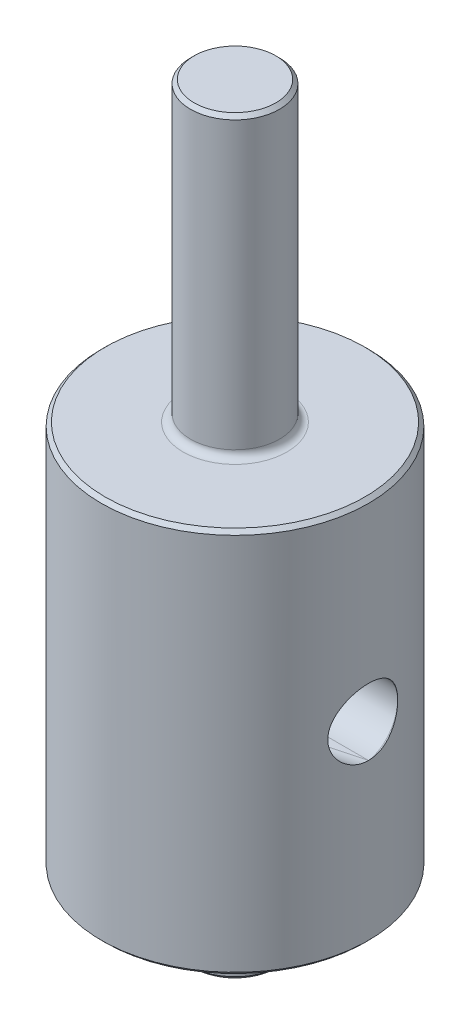
ISO-10303-21;
HEADER;
FILE_DESCRIPTION(('STEP AP214'),'2;1');
FILE_NAME('part.step','',(''),(''),'','','');
FILE_SCHEMA(('AUTOMOTIVE_DESIGN { 1 0 10303 214 1 1 1 1 }'));
ENDSEC;
DATA;
#1=APPLICATION_CONTEXT('core data for automotive mechanical design processes');
#2=APPLICATION_PROTOCOL_DEFINITION('international standard','automotive_design',2000,#1);
#3=PRODUCT_CONTEXT('',#1,'mechanical');
#4=PRODUCT('Part','Part','',(#3));
#5=PRODUCT_RELATED_PRODUCT_CATEGORY('part','',(#4));
#6=PRODUCT_DEFINITION_FORMATION('','',#4);
#7=PRODUCT_DEFINITION_CONTEXT('part definition',#1,'design');
#8=PRODUCT_DEFINITION('design','',#6,#7);
#9=PRODUCT_DEFINITION_SHAPE('','',#8);
#10=(LENGTH_UNIT() NAMED_UNIT(*) SI_UNIT(.MILLI.,.METRE.));
#11=(NAMED_UNIT(*) PLANE_ANGLE_UNIT() SI_UNIT($,.RADIAN.));
#12=(NAMED_UNIT(*) SI_UNIT($,.STERADIAN.) SOLID_ANGLE_UNIT());
#13=UNCERTAINTY_MEASURE_WITH_UNIT(LENGTH_MEASURE(1.E-05),#10,'distance_accuracy_value','');
#14=(GEOMETRIC_REPRESENTATION_CONTEXT(3) GLOBAL_UNCERTAINTY_ASSIGNED_CONTEXT((#13)) GLOBAL_UNIT_ASSIGNED_CONTEXT((#10,
#11,#12)) REPRESENTATION_CONTEXT('',''));
#15=CARTESIAN_POINT('',(0.,0.,0.));
#16=DIRECTION('',(0.,0.,1.));
#17=DIRECTION('',(1.,0.,0.));
#18=AXIS2_PLACEMENT_3D('',#15,#16,#17);
#19=CARTESIAN_POINT('',(11.25,0.,-0.602885682970028));
#20=DIRECTION('',(-0.965925826289068,0.,0.258819045102521));
#21=DIRECTION('',(0.258819045102521,0.,0.965925826289068));
#22=AXIS2_PLACEMENT_3D('',#19,#20,#21);
#23=CYLINDRICAL_SURFACE('',#22,2.25);
#24=DIRECTION('',(0.965925826289068,0.,-0.258819045102521));
#25=VECTOR('',#24,1.);
#26=CARTESIAN_POINT('',(-10.4287614698095,-2.25,5.20592094577239));
#27=LINE('',#26,#25);
#28=CARTESIAN_POINT('',(-7.79422863405994,-2.25,4.50000000000001));
#29=VERTEX_POINT('',#28);
#30=CARTESIAN_POINT('',(9.,-2.25,0.));
#31=VERTEX_POINT('',#30);
#32=EDGE_CURVE('E69',#29,#31,#27,.T.);
#33=ORIENTED_EDGE('',*,*,#32,.F.);
#34=CARTESIAN_POINT('',(-6.2986309684237,0.,6.4286272192136));
#35=CARTESIAN_POINT('',(-6.29863572562921,0.115420645557257,6.428624407061));
#36=CARTESIAN_POINT('',(-6.3060602838156,0.230878962906398,6.42137370973188));
#37=CARTESIAN_POINT('',(-6.33512109848462,0.458218917145717,6.39270188036307));
#38=CARTESIAN_POINT('',(-6.3567683340453,0.570097720835036,6.37126980103204));
#39=CARTESIAN_POINT('',(-6.41242453029494,0.78670447934925,6.3152472056288));
#40=CARTESIAN_POINT('',(-6.44638221658226,0.891459984994621,6.2807112412774));
#41=CARTESIAN_POINT('',(-6.52441532590811,1.09212368629617,6.19960971245666));
#42=CARTESIAN_POINT('',(-6.56849300705771,1.18802990067239,6.15304146288881));
#43=CARTESIAN_POINT('',(-6.66787542719835,1.37599197932501,6.04526066182345));
#44=CARTESIAN_POINT('',(-6.72376022801728,1.46727267152965,5.9832347848784));
#45=CARTESIAN_POINT('',(-6.84174874506253,1.63651923315656,5.8479513900165));
#46=CARTESIAN_POINT('',(-6.90385527941814,1.71447902523652,5.77468877437664));
#47=CARTESIAN_POINT('',(-7.03939861788815,1.86424788131121,5.60888743463548));
#48=CARTESIAN_POINT('',(-7.11330801596242,1.93424855635128,5.51509447487221));
#49=CARTESIAN_POINT('',(-7.26276858582111,2.05452364569838,5.31673000401394));
#50=CARTESIAN_POINT('',(-7.33832026687979,2.1047918461138,5.2121551106831));
#51=CARTESIAN_POINT('',(-7.49057807446588,2.18518458802696,4.99097133267824));
#52=CARTESIAN_POINT('',(-7.56724722608848,2.2146353310375,4.87408964345249));
#53=CARTESIAN_POINT('',(-7.71646007617074,2.24913379886119,4.63423781835183));
#54=CARTESIAN_POINT('',(-7.78900533974565,2.25419084360776,4.51127002589662));
#55=CARTESIAN_POINT('',(-7.92385182822738,2.23921005722015,4.26974209030992));
#56=CARTESIAN_POINT('',(-7.98649124915509,2.22047892995192,4.15129057209001));
#57=CARTESIAN_POINT('',(-8.10419519406083,2.15996401217146,3.91653502097405));
#58=CARTESIAN_POINT('',(-8.15926253547756,2.11818882510589,3.80023020334988));
#59=CARTESIAN_POINT('',(-8.25776113353527,2.01560967239165,3.58092038777548));
#60=CARTESIAN_POINT('',(-8.30169093853679,1.95609127547807,3.47753592764894));
#61=CARTESIAN_POINT('',(-8.38164675783941,1.81895528829501,3.28014439330144));
#62=CARTESIAN_POINT('',(-8.4176735688114,1.74133952398132,3.18613637439842));
#63=CARTESIAN_POINT('',(-8.4813766537205,1.57178662880977,3.0124201997295));
#64=CARTESIAN_POINT('',(-8.50919398505658,1.48013832272008,2.93248136388815));
#65=CARTESIAN_POINT('',(-8.55778682532547,1.28408324493627,2.78749818442494));
#66=CARTESIAN_POINT('',(-8.5785620965331,1.17967604269037,2.72245434365095));
#67=CARTESIAN_POINT('',(-8.61377201375056,0.960065530946159,2.608929002455));
#68=CARTESIAN_POINT('',(-8.62815045340775,0.844776908229935,2.56059511952854));
#69=CARTESIAN_POINT('',(-8.65083340110135,0.607411382763267,2.48288750415837));
#70=CARTESIAN_POINT('',(-8.65913768828507,0.485334233359531,2.45351446112445));
#71=CARTESIAN_POINT('',(-8.67008048728678,0.236857570319109,2.41456499172959));
#72=CARTESIAN_POINT('',(-8.67267544790419,0.110432252928292,2.40514075696676));
#73=CARTESIAN_POINT('',(-8.67219751366162,-0.142268545365695,2.40686318857274));
#74=CARTESIAN_POINT('',(-8.66912451553205,-0.268544023496864,2.41801022974793));
#75=CARTESIAN_POINT('',(-8.65715387573318,-0.517517854612789,2.46052203867228));
#76=CARTESIAN_POINT('',(-8.64824925913011,-0.640211740022707,2.49191101619238));
#77=CARTESIAN_POINT('',(-8.62421236615811,-0.878377270072894,2.57386329992728));
#78=CARTESIAN_POINT('',(-8.60908000496078,-0.993848816312671,2.6244268673193));
#79=CARTESIAN_POINT('',(-8.57205213944146,-1.21415256544937,2.74294663140657));
#80=CARTESIAN_POINT('',(-8.55016367391666,-1.31899569116797,2.81088471402045));
#81=CARTESIAN_POINT('',(-8.49904486992793,-1.51515452308034,2.96185190294187));
#82=CARTESIAN_POINT('',(-8.46981504685822,-1.60647117817417,3.04487994975732));
#83=CARTESIAN_POINT('',(-8.40384326654009,-1.77231366502419,3.22246844850753));
#84=CARTESIAN_POINT('',(-8.36716006476566,-1.84696178407205,3.31693649876167));
#85=CARTESIAN_POINT('',(-8.28606008973115,-1.97828129373805,3.51462690249678));
#86=CARTESIAN_POINT('',(-8.24164420023817,-2.03495473659138,3.61784825487416));
#87=CARTESIAN_POINT('',(-8.14587050991866,-2.12853459341272,3.82858464031527));
#88=CARTESIAN_POINT('',(-8.09457748565702,-2.1656111713848,3.93605369911621));
#89=CARTESIAN_POINT('',(-7.98560105577117,-2.2201622548549,4.15269515826185));
#90=CARTESIAN_POINT('',(-7.92791726302396,-2.23763557216455,4.26186766144874));
#91=CARTESIAN_POINT('',(-7.8064627399753,-2.2532286711866,4.48051702474105));
#92=CARTESIAN_POINT('',(-7.74260781604153,-2.25102691326248,4.58996960492615));
#93=CARTESIAN_POINT('',(-7.61133141525705,-2.22723790138717,4.80452612877819));
#94=CARTESIAN_POINT('',(-7.54390907227507,-2.20564591918363,4.90962900524241));
#95=CARTESIAN_POINT('',(-7.40368700760956,-2.14247693844326,5.11880139853705));
#96=CARTESIAN_POINT('',(-7.33079536390484,-2.09986710762043,5.22249687911003));
#97=CARTESIAN_POINT('',(-7.18566990287537,-1.99573590270148,5.4204461433094));
#98=CARTESIAN_POINT('',(-7.11343636939443,-1.9342067325446,5.51469601343077));
#99=CARTESIAN_POINT('',(-6.96808985738204,-1.78946346248777,5.6973807162314));
#100=CARTESIAN_POINT('',(-6.89518353138152,-1.70517091423079,5.78512871402776));
#101=CARTESIAN_POINT('',(-6.75667498207226,-1.51863287423205,5.94631447067187));
#102=CARTESIAN_POINT('',(-6.69107582137067,-1.41637990076988,6.01974623884784));
#103=CARTESIAN_POINT('',(-6.57183008781377,-1.19703132919625,6.14969612074955));
#104=CARTESIAN_POINT('',(-6.51807249243096,-1.08009130507523,6.20637320763919));
#105=CARTESIAN_POINT('',(-6.42605821431225,-0.833521771282112,6.30160344845743));
#106=CARTESIAN_POINT('',(-6.38776882517395,-0.703919763209805,6.34019487118341));
#107=CARTESIAN_POINT('',(-6.33934183170501,-0.477861263387974,6.38854526595828));
#108=CARTESIAN_POINT('',(-6.32415889206566,-0.38356198653444,6.40353131951988));
#109=CARTESIAN_POINT('',(-6.30380294632095,-0.192850152597827,6.42357200922269));
#110=CARTESIAN_POINT('',(-6.29862699360223,-0.0964382260554079,6.42862956887129));
#111=CARTESIAN_POINT('',(-6.2986309684237,0.,6.4286272192136));
#112=B_SPLINE_CURVE_WITH_KNOTS('',3,(#34,#35,#36,#37,#38,#39,#40,#41,#42,#43,#44,#45,#46,#47,
#48,#49,#50,#51,#52,#53,#54,#55,#56,#57,#58,#59,#60,#61,#62,#63,#64,#65,#66,#67,#68,#69,#70,#71,
#72,#73,#74,#75,#76,#77,#78,#79,#80,#81,#82,#83,#84,#85,#86,#87,#88,#89,#90,#91,#92,#93,#94,#95,
#96,#97,#98,#99,#100,#101,#102,#103,#104,#105,#106,#107,#108,#109,#110,#111),.UNSPECIFIED.,.T.,
.F.,(4,2,2,2,2,2,2,2,2,2,2,2,2,2,2,2,2,2,2,2,2,2,2,2,2,2,2,2,2,2,2,2,2,2,2,2,2,2,4),(0.,
0.345877961457703,0.692023234739047,1.03674303415902,1.38153982703779,1.75117699978304,
2.12098236297531,2.53438092029154,2.94790955541438,3.37427601824991,3.8004795692583,
4.204252580168,4.6078749452831,4.98738996171283,5.36686670307259,5.73938241737213,
6.11191070576972,6.48765054778276,6.86340405080125,7.24201403637018,7.62063092023952,
7.99970147963442,8.37877720253762,8.75745931371099,9.13611484723241,9.51189379136419,
9.88762981596774,10.2600472924912,10.6324873406787,11.0110249766264,11.389654942997,
11.7890874589759,12.1886847895261,12.6122260505673,13.0359441651727,13.455502400953,
13.8741688086731,14.1632477952196,14.452241647867),.UNSPECIFIED.);
#113=CARTESIAN_POINT('',(-7.79422863405994,2.25,4.50000000000001));
#114=VERTEX_POINT('',#113);
#115=EDGE_CURVE('E101',#29,#114,#112,.T.);
#116=ORIENTED_EDGE('',*,*,#115,.T.);
#117=DIRECTION('',(0.965925826289068,0.,-0.258819045102521));
#118=VECTOR('',#117,1.);
#119=CARTESIAN_POINT('',(-10.4287614698095,2.25,5.20592094577239));
#120=LINE('',#119,#118);
#121=CARTESIAN_POINT('',(9.,2.25,0.));
#122=VERTEX_POINT('',#121);
#123=EDGE_CURVE('E97',#114,#122,#120,.T.);
#124=ORIENTED_EDGE('',*,*,#123,.T.);
#125=CARTESIAN_POINT('',(8.66908803732511,0.,2.41803899908722));
#126=CARTESIAN_POINT('',(8.66909075110964,-0.115420645557257,2.41803418508888));
#127=CARTESIAN_POINT('',(8.67189525844636,-0.230878962906399,2.40804261791352));
#128=CARTESIAN_POINT('',(8.68272674751999,-0.458218917145719,2.36868167797264));
#129=CARTESIAN_POINT('',(8.69075776377174,-0.570097720835037,2.33929733503571));
#130=CARTESIAN_POINT('',(8.71094614590032,-0.786704479349252,2.26295224610574));
#131=CARTESIAN_POINT('',(8.72308638270318,-0.891459984994622,2.21606438048958));
#132=CARTESIAN_POINT('',(8.75011427330529,-1.09212368629617,2.10681184158214));
#133=CARTESIAN_POINT('',(8.76500254013683,-1.18802990067239,2.0444437138718));
#134=CARTESIAN_POINT('',(8.79717984013551,-1.37599197932501,1.90141159203865));
#135=CARTESIAN_POINT('',(8.81456455885762,-1.46727267152965,1.81975320650276));
#136=CARTESIAN_POINT('',(8.84910391454271,-1.63651923315656,1.64360009131953));
#137=CARTESIAN_POINT('',(8.86625844321575,-1.71447902523652,1.54909953784991));
#138=CARTESIAN_POINT('',(8.90074174777395,-1.86424788131121,1.33773969641756));
#139=CARTESIAN_POINT('',(8.91785268420305,-1.93424855635128,1.21955791152931));
#140=CARTESIAN_POINT('',(8.94810709913564,-2.05452364569838,0.973038955628434));
#141=CARTESIAN_POINT('',(8.96124932756566,-2.1047918461138,0.844698600876545));
#142=CARTESIAN_POINT('',(8.9825165678573,-2.18518458802696,0.577018926426271));
#143=CARTESIAN_POINT('',(8.9904731562362,-2.2146353310375,0.437461838508236));
#144=CARTESIAN_POINT('',(8.99976936242819,-2.24913379886119,0.155137639785871));
#145=CARTESIAN_POINT('',(9.00111150738068,-2.25419084360776,0.0123717758849104));
#146=CARTESIAN_POINT('',(8.99712802422364,-2.23921005722015,-0.264220796297642));
#147=CARTESIAN_POINT('',(8.99214959491542,-2.22047892995192,-0.398122530656776));
#148=CARTESIAN_POINT('',(8.97670642577146,-2.15996401217146,-0.660278774055481));
#149=CARTESIAN_POINT('',(8.96624373354513,-2.11818882510589,-0.788535371408894));
#150=CARTESIAN_POINT('',(8.94189111391307,-2.01560967239165,-1.02771254202446));
#151=CARTESIAN_POINT('',(8.92824321096441,-1.95609127547807,-1.13921101335134));
#152=CARTESIAN_POINT('',(8.89879121448712,-1.81895528829501,-1.35013500623958));
#153=CARTESIAN_POINT('',(8.8829873385547,-1.74133952398132,-1.44956174425504));
#154=CARTESIAN_POINT('',(8.85129774105096,-1.57178662880977,-1.63185590702113));
#155=CARTESIAN_POINT('',(8.83541883873281,-1.48013832272008,-1.71499363527673));
#156=CARTESIAN_POINT('',(8.80500988311611,-1.28408324493627,-1.86484917194776));
#157=CARTESIAN_POINT('',(8.79047987536543,-1.17967604269037,-1.93156642602155));
#158=CARTESIAN_POINT('',(8.76420988754292,-0.960065530946158,-2.04748721407927));
#159=CARTESIAN_POINT('',(8.7524950400896,-0.844776908229933,-2.09653480438572));
#160=CARTESIAN_POINT('',(8.73328524133989,-0.607411382763265,-2.1751730472106));
#161=CARTESIAN_POINT('',(8.72579044348435,-0.485334233359529,-2.20476299225628));
#162=CARTESIAN_POINT('',(8.71579245071091,-0.236857570319108,-2.24396562171702));
#163=CARTESIAN_POINT('',(8.71332763514599,-0.110432252928292,-2.25342472874156));
#164=CARTESIAN_POINT('',(8.71377494775358,0.142268545365695,-2.25169409209322));
#165=CARTESIAN_POINT('',(8.71668717389518,0.268544023496866,-2.24050397219368));
#166=CARTESIAN_POINT('',(8.72757620019198,0.517517854612791,-2.19770234580494));
#167=CARTESIAN_POINT('',(8.73555906476282,0.640211740022709,-2.16606638557217));
#168=CARTESIAN_POINT('',(8.75571864668846,0.878377270072896,-2.0830751794736));
#169=CARTESIAN_POINT('',(8.76789542116834,0.993848816312672,-2.03171966500748));
#170=CARTESIAN_POINT('',(8.79508823102433,1.21415256544937,-1.9105646056977));
#171=CARTESIAN_POINT('',(8.81010130513694,1.31899569116797,-1.84078426750727));
#172=CARTESIAN_POINT('',(8.84131471673233,1.51515452308034,-1.68448344476903));
#173=CARTESIAN_POINT('',(8.85751497081356,1.60647117817417,-1.5979641354654));
#174=CARTESIAN_POINT('',(8.88917598250029,1.77231366502419,-1.41118209396871));
#175=CARTESIAN_POINT('',(8.90464142299855,1.84696178407205,-1.31102876171542));
#176=CARTESIAN_POINT('',(8.93325198623993,1.97828129373805,-1.09927386247916));
#177=CARTESIAN_POINT('',(8.94639737379601,2.03495473659138,-0.987673604360878));
#178=CARTESIAN_POINT('',(8.96882311768569,2.12853459341272,-0.757283695907413));
#179=CARTESIAN_POINT('',(8.97813658503865,2.1656111713848,-0.638566248734171));
#180=CARTESIAN_POINT('',(8.99208095791659,2.2201622548549,-0.396461026658196));
#181=CARTESIAN_POINT('',(8.99671157960432,2.23763557216455,-0.273072969130008));
#182=CARTESIAN_POINT('',(9.00085355888581,2.2532286711866,-0.0229898044732399));
#183=CARTESIAN_POINT('',(9.00027986269499,2.25102691326248,0.103726372443697));
#184=CARTESIAN_POINT('',(8.99386942662426,2.22723790138717,0.355175973039477));
#185=CARTESIAN_POINT('',(8.98803140305131,2.20564591918363,0.479908905559302));
#186=CARTESIAN_POINT('',(8.9711817295272,2.14247693844327,0.731168544255608));
#187=CARTESIAN_POINT('',(8.9599034546418,2.09986710762043,0.857417286541804));
#188=CARTESIAN_POINT('',(8.93319575075403,1.99573590270148,1.10140910851363));
#189=CARTESIAN_POINT('',(8.91776461081511,1.9342067325446,1.21914865708259));
#190=CARTESIAN_POINT('',(8.88323319046123,1.78946346248777,1.45003150659694));
#191=CARTESIAN_POINT('',(8.86396845894638,1.70517091423079,1.56247666482007));
#192=CARTESIAN_POINT('',(8.82460941492528,1.51863287423206,1.77132189945671));
#193=CARTESIAN_POINT('',(8.80451475937875,1.41637990076989,1.86771525649271));
#194=CARTESIAN_POINT('',(8.76621986577642,1.19703132919625,2.03987802221683));
#195=CARTESIAN_POINT('',(8.74800296597337,1.08009130507523,2.11584061696716));
#196=CARTESIAN_POINT('',(8.7159313840208,0.833521771282111,2.24431956378361));
#197=CARTESIAN_POINT('',(8.70206751169463,0.703919763209804,2.29688541080165));
#198=CARTESIAN_POINT('',(8.68430370250906,0.477861263387973,2.36297157769416));
#199=CARTESIAN_POINT('',(8.67864791785805,0.38356198653444,2.38354135060067));
#200=CARTESIAN_POINT('',(8.67103949657648,0.192850152597827,2.41107506986501));
#201=CARTESIAN_POINT('',(8.66908576985759,0.0964382260554081,2.41804302136122));
#202=CARTESIAN_POINT('',(8.66908803732511,0.,2.41803899908722));
#203=B_SPLINE_CURVE_WITH_KNOTS('',3,(#125,#126,#127,#128,#129,#130,#131,#132,#133,#134,#135,
#136,#137,#138,#139,#140,#141,#142,#143,#144,#145,#146,#147,#148,#149,#150,#151,#152,#153,#154,
#155,#156,#157,#158,#159,#160,#161,#162,#163,#164,#165,#166,#167,#168,#169,#170,#171,#172,#173,
#174,#175,#176,#177,#178,#179,#180,#181,#182,#183,#184,#185,#186,#187,#188,#189,#190,#191,#192,
#193,#194,#195,#196,#197,#198,#199,#200,#201,#202),.UNSPECIFIED.,.T.,.F.,(4,2,2,2,2,2,2,2,2,2,2,
2,2,2,2,2,2,2,2,2,2,2,2,2,2,2,2,2,2,2,2,2,2,2,2,2,2,2,4),(0.,0.345877961457704,
0.692023234739049,1.03674303415902,1.38153982703779,1.75117699978304,2.12098236297532,
2.53438092029155,2.94790955541439,3.37427601824992,3.8004795692583,4.204252580168,
4.6078749452831,4.98738996171283,5.36686670307259,5.73938241737213,6.11191070576972,
6.48765054778276,6.86340405080125,7.24201403637019,7.62063092023952,7.99970147963442,
8.37877720253762,8.757459313711,9.13611484723242,9.51189379136419,9.88762981596775,
10.2600472924912,10.6324873406787,11.0110249766264,11.389654942997,11.7890874589759,
12.1886847895261,12.6122260505673,13.0359441651727,13.455502400953,13.8741688086731,
14.1632477952196,14.452241647867),.UNSPECIFIED.);
#204=EDGE_CURVE('E96',#122,#31,#203,.T.);
#205=ORIENTED_EDGE('',*,*,#204,.T.);
#206=EDGE_LOOP('',(#33,#116,#124,#205));
#207=FACE_BOUND('',#206,.T.);
#208=ADVANCED_FACE('F37',(#207),#23,.F.);
#209=CARTESIAN_POINT('',(3.,-17.5,0.));
#210=DIRECTION('',(0.,-1.,0.));
#211=DIRECTION('',(0.,0.,-1.));
#212=AXIS2_PLACEMENT_3D('',#209,#210,#211);
#213=PLANE('',#212);
#214=CARTESIAN_POINT('',(0.,-17.5,0.));
#215=DIRECTION('',(0.,-1.,0.));
#216=DIRECTION('',(0.,0.,-1.));
#217=AXIS2_PLACEMENT_3D('',#214,#215,#216);
#218=CIRCLE('',#217,2.75);
#219=CARTESIAN_POINT('',(0.,-17.5,-2.75));
#220=VERTEX_POINT('',#219);
#221=EDGE_CURVE('E140',#220,#220,#218,.T.);
#222=ORIENTED_EDGE('',*,*,#221,.T.);
#223=EDGE_LOOP('',(#222));
#224=FACE_BOUND('',#223,.T.);
#225=ADVANCED_FACE('F185',(#224),#213,.T.);
#226=CARTESIAN_POINT('',(0.,33.,0.));
#227=DIRECTION('',(0.,1.,0.));
#228=DIRECTION('',(0.,0.,1.));
#229=AXIS2_PLACEMENT_3D('',#226,#227,#228);
#230=PLANE('',#229);
#231=CARTESIAN_POINT('',(0.,33.,0.));
#232=DIRECTION('',(0.,1.,0.));
#233=DIRECTION('',(0.,0.,1.));
#234=AXIS2_PLACEMENT_3D('',#231,#232,#233);
#235=CIRCLE('',#234,2.75);
#236=CARTESIAN_POINT('',(0.,33.,2.75));
#237=VERTEX_POINT('',#236);
#238=EDGE_CURVE('E149',#237,#237,#235,.T.);
#239=ORIENTED_EDGE('',*,*,#238,.T.);
#240=EDGE_LOOP('',(#239));
#241=FACE_BOUND('',#240,.T.);
#242=ADVANCED_FACE('F189',(#241),#230,.T.);
#243=CARTESIAN_POINT('',(0.,0.,0.));
#244=DIRECTION('',(0.,-1.,0.));
#245=DIRECTION('',(0.,0.,-1.));
#246=AXIS2_PLACEMENT_3D('',#243,#244,#245);
#247=CYLINDRICAL_SURFACE('',#246,3.);
#248=CARTESIAN_POINT('',(0.,32.75,0.));
#249=DIRECTION('',(0.,1.,0.));
#250=DIRECTION('',(0.,0.,1.));
#251=AXIS2_PLACEMENT_3D('',#248,#249,#250);
#252=CIRCLE('',#251,3.);
#253=CARTESIAN_POINT('',(0.,32.75,3.));
#254=VERTEX_POINT('',#253);
#255=EDGE_CURVE('E146',#254,#254,#252,.F.);
#256=ORIENTED_EDGE('',*,*,#255,.T.);
#257=EDGE_LOOP('',(#256));
#258=FACE_BOUND('',#257,.T.);
#259=CARTESIAN_POINT('',(0.,13.5,0.));
#260=DIRECTION('',(0.,1.,0.));
#261=DIRECTION('',(0.,0.,1.));
#262=AXIS2_PLACEMENT_3D('',#259,#260,#261);
#263=CIRCLE('',#262,3.);
#264=CARTESIAN_POINT('',(0.,13.5,3.));
#265=VERTEX_POINT('',#264);
#266=EDGE_CURVE('E137',#265,#265,#263,.T.);
#267=ORIENTED_EDGE('',*,*,#266,.T.);
#268=EDGE_LOOP('',(#267));
#269=FACE_BOUND('',#268,.T.);
#270=ADVANCED_FACE('F195',(#258,#269),#247,.T.);
#271=CARTESIAN_POINT('',(9.,13.,0.));
#272=DIRECTION('',(0.,1.,0.));
#273=DIRECTION('',(0.,0.,1.));
#274=AXIS2_PLACEMENT_3D('',#271,#272,#273);
#275=PLANE('',#274);
#276=CARTESIAN_POINT('',(0.,13.,0.));
#277=DIRECTION('',(0.,1.,0.));
#278=DIRECTION('',(0.,0.,1.));
#279=AXIS2_PLACEMENT_3D('',#276,#277,#278);
#280=CIRCLE('',#279,8.74999999999999);
#281=CARTESIAN_POINT('',(0.,13.,8.74999999999999));
#282=VERTEX_POINT('',#281);
#283=EDGE_CURVE('E11',#282,#282,#280,.T.);
#284=ORIENTED_EDGE('',*,*,#283,.T.);
#285=EDGE_LOOP('',(#284));
#286=FACE_BOUND('',#285,.T.);
#287=CARTESIAN_POINT('',(0.,13.,0.));
#288=DIRECTION('',(0.,1.,0.));
#289=DIRECTION('',(0.,0.,1.));
#290=AXIS2_PLACEMENT_3D('',#287,#288,#289);
#291=CIRCLE('',#290,3.5);
#292=CARTESIAN_POINT('',(0.,13.,3.5));
#293=VERTEX_POINT('',#292);
#294=EDGE_CURVE('E134',#293,#293,#291,.F.);
#295=ORIENTED_EDGE('',*,*,#294,.T.);
#296=EDGE_LOOP('',(#295));
#297=FACE_BOUND('',#296,.T.);
#298=ADVANCED_FACE('F217',(#286,#297),#275,.T.);
#299=CARTESIAN_POINT('',(0.,0.,0.));
#300=DIRECTION('',(0.,-1.,0.));
#301=DIRECTION('',(0.,0.,-1.));
#302=AXIS2_PLACEMENT_3D('',#299,#300,#301);
#303=CYLINDRICAL_SURFACE('',#302,9.);
#304=CARTESIAN_POINT('',(0.,-12.75,0.));
#305=DIRECTION('',(0.,-1.,0.));
#306=DIRECTION('',(0.,0.,-1.));
#307=AXIS2_PLACEMENT_3D('',#304,#305,#306);
#308=CIRCLE('',#307,9.);
#309=CARTESIAN_POINT('',(0.,-12.75,-9.));
#310=VERTEX_POINT('',#309);
#311=EDGE_CURVE('E45',#310,#310,#308,.F.);
#312=ORIENTED_EDGE('',*,*,#311,.T.);
#313=EDGE_LOOP('',(#312));
#314=FACE_BOUND('',#313,.T.);
#315=CARTESIAN_POINT('',(0.,12.75,0.));
#316=DIRECTION('',(0.,1.,0.));
#317=DIRECTION('',(0.,0.,1.));
#318=AXIS2_PLACEMENT_3D('',#315,#316,#317);
#319=CIRCLE('',#318,9.);
#320=CARTESIAN_POINT('',(0.,12.75,9.));
#321=VERTEX_POINT('',#320);
#322=EDGE_CURVE('E155',#321,#321,#319,.F.);
#323=ORIENTED_EDGE('',*,*,#322,.T.);
#324=EDGE_LOOP('',(#323));
#325=FACE_BOUND('',#324,.T.);
#326=CARTESIAN_POINT('',(0.,-2.25,0.));
#327=DIRECTION('',(0.,-1.,0.));
#328=DIRECTION('',(0.,0.,-1.));
#329=AXIS2_PLACEMENT_3D('',#326,#327,#328);
#330=CIRCLE('',#329,9.);
#331=CARTESIAN_POINT('',(-9.,-2.25,0.));
#332=VERTEX_POINT('',#331);
#333=EDGE_CURVE('E52',#332,#29,#330,.F.);
#334=ORIENTED_EDGE('',*,*,#333,.F.);
#335=CARTESIAN_POINT('',(-8.71421252896669,0.,2.25));
#336=CARTESIAN_POINT('',(-8.71421490079074,0.124245675833919,2.24999647073377));
#337=CARTESIAN_POINT('',(-8.71689875413138,0.24853040881067,2.23967362094789));
#338=CARTESIAN_POINT('',(-8.72731675793308,0.493530820356158,2.19872081291741));
#339=CARTESIAN_POINT('',(-8.73505384759467,0.614244379021367,2.16807903606789));
#340=CARTESIAN_POINT('',(-8.75464852136536,0.848523184368463,2.08754207966884));
#341=CARTESIAN_POINT('',(-8.76650078421412,0.962097439847137,2.03767175506904));
#342=CARTESIAN_POINT('',(-8.79298372825883,1.17927976728589,1.92016902713525));
#343=CARTESIAN_POINT('',(-8.8076145274064,1.2828874158722,1.85253586970462));
#344=CARTESIAN_POINT('',(-8.83836644720063,1.47947548073599,1.69983758458069));
#345=CARTESIAN_POINT('',(-8.85451137860731,1.57220424031504,1.61445319893365));
#346=CARTESIAN_POINT('',(-8.88626587963765,1.7421852549243,1.4293638576906));
#347=CARTESIAN_POINT('',(-8.9018753990975,1.81943606305957,1.32965756476228));
#348=CARTESIAN_POINT('',(-8.93106373968524,1.95729792086815,1.11703068097106));
#349=CARTESIAN_POINT('',(-8.94461118660534,2.01766174934532,1.00394511857561));
#350=CARTESIAN_POINT('',(-8.96787730733386,2.11842867973777,0.768836865863486));
#351=CARTESIAN_POINT('',(-8.9775965460091,2.15883472672396,0.646815497212746));
#352=CARTESIAN_POINT('',(-8.99194282963362,2.21773305112073,0.399922882878745));
#353=CARTESIAN_POINT('',(-8.99666904459883,2.23665267989392,0.275159447594078));
#354=CARTESIAN_POINT('',(-9.00084234696568,2.253382541348,0.0241459373364922));
#355=CARTESIAN_POINT('',(-9.00029021487035,2.25119589498864,-0.102103915084262));
#356=CARTESIAN_POINT('',(-8.9940428545818,2.22608263477487,-0.349542556137871));
#357=CARTESIAN_POINT('',(-8.98846202106784,2.20361730745153,-0.470781485102401));
#358=CARTESIAN_POINT('',(-8.97291752872372,2.13932585695635,-0.707711056680794));
#359=CARTESIAN_POINT('',(-8.96295363658607,2.09749870316033,-0.823401403583485));
#360=CARTESIAN_POINT('',(-8.93958758730796,1.99529768638164,-1.04716508287906));
#361=CARTESIAN_POINT('',(-8.9261551772551,1.93475965980443,-1.15516014697463));
#362=CARTESIAN_POINT('',(-8.89730913428723,1.79697988879537,-1.3596201502661));
#363=CARTESIAN_POINT('',(-8.88189515687385,1.71973523829544,-1.45608307894239));
#364=CARTESIAN_POINT('',(-8.85027342392421,1.54826213221587,-1.63749157894115));
#365=CARTESIAN_POINT('',(-8.83405547572768,1.45363059688703,-1.72205477791919));
#366=CARTESIAN_POINT('',(-8.80303539165594,1.25136002381375,-1.8741968459168));
#367=CARTESIAN_POINT('',(-8.7882333219746,1.14372037845801,-1.94177492110356));
#368=CARTESIAN_POINT('',(-8.76168447146387,0.917738969266026,-2.05827329030082));
#369=CARTESIAN_POINT('',(-8.74995285345307,0.799347842718478,-2.10710152568351));
#370=CARTESIAN_POINT('',(-8.73106776133802,0.555673078730842,-2.18404264643186));
#371=CARTESIAN_POINT('',(-8.7239133075846,0.430390922413863,-2.21215996474439));
#372=CARTESIAN_POINT('',(-8.71519820406711,0.180036448623074,-2.24624667479933));
#373=CARTESIAN_POINT('',(-8.71349480079241,0.0550459859930789,-2.25278142652721));
#374=CARTESIAN_POINT('',(-8.71548609028223,-0.194239742926728,-2.24506529146364));
#375=CARTESIAN_POINT('',(-8.71918028613271,-0.318535072154497,-2.23081631806482));
#376=CARTESIAN_POINT('',(-8.73141373786482,-0.560802838453716,-2.18243291754443));
#377=CARTESIAN_POINT('',(-8.73987273218279,-0.678845453912279,-2.14862766145371));
#378=CARTESIAN_POINT('',(-8.76060646436525,-0.907588312067995,-2.06245627350342));
#379=CARTESIAN_POINT('',(-8.77288165421767,-1.01828768315021,-2.01008794294125));
#380=CARTESIAN_POINT('',(-8.8001652338596,-1.23159715008021,-1.88709360114294));
#381=CARTESIAN_POINT('',(-8.81522251746521,-1.33400595603868,-1.81612957845208));
#382=CARTESIAN_POINT('',(-8.84625374764002,-1.52566952652133,-1.65838565910252));
#383=CARTESIAN_POINT('',(-8.86222784455476,-1.6149221249851,-1.57160316331224));
#384=CARTESIAN_POINT('',(-8.89377662728596,-1.78002993831383,-1.38209112221564));
#385=CARTESIAN_POINT('',(-8.90933131855692,-1.85549405629392,-1.27901689319608));
#386=CARTESIAN_POINT('',(-8.93787494952321,-1.98804228025613,-1.06133103606302));
#387=CARTESIAN_POINT('',(-8.95086402303554,-2.04512734494739,-0.946720010154579));
#388=CARTESIAN_POINT('',(-8.97273104164493,-2.13880143107514,-0.710005953894954));
#389=CARTESIAN_POINT('',(-8.98163847020169,-2.17553785594116,-0.587964107312735));
#390=CARTESIAN_POINT('',(-8.9944676405621,-2.22791430114757,-0.339186960717316));
#391=CARTESIAN_POINT('',(-8.9983903445408,-2.24355839286514,-0.212452571342791));
#392=CARTESIAN_POINT('',(-9.00076881169814,-2.25307707654496,0.0384379344974772));
#393=CARTESIAN_POINT('',(-8.99936952479974,-2.24752884546467,0.162571110673549));
#394=CARTESIAN_POINT('',(-8.99158267029248,-2.21614238858771,0.408076866933189));
#395=CARTESIAN_POINT('',(-8.98519525103631,-2.19030476622037,0.529449529007089));
#396=CARTESIAN_POINT('',(-8.96817223921251,-2.11938250551556,0.765384830200741));
#397=CARTESIAN_POINT('',(-8.95755970130383,-2.07440223004265,0.87998061280694));
#398=CARTESIAN_POINT('',(-8.9332040005573,-1.96656619720596,1.10006336934365));
#399=CARTESIAN_POINT('',(-8.91946044312205,-1.90370818649141,1.20554919284767));
#400=CARTESIAN_POINT('',(-8.88991311780646,-1.7601407235087,1.40715433895243));
#401=CARTESIAN_POINT('',(-8.87406788118746,-1.67903967846638,1.50298872367126));
#402=CARTESIAN_POINT('',(-8.84228960378677,-1.50204858305097,1.67988379561538));
#403=CARTESIAN_POINT('',(-8.8263565417643,-1.40615478874988,1.76094073142233));
#404=CARTESIAN_POINT('',(-8.79586820652381,-1.20014681807371,1.90746455956162));
#405=CARTESIAN_POINT('',(-8.781344182649,-1.08980072242818,1.97261239368685));
#406=CARTESIAN_POINT('',(-8.75573899863363,-0.859375147781656,2.08333551731731));
#407=CARTESIAN_POINT('',(-8.74465533524731,-0.739302826288845,2.12892504694234));
#408=CARTESIAN_POINT('',(-8.72891794689159,-0.516201723370888,2.19245068928476));
#409=CARTESIAN_POINT('',(-8.72344491757873,-0.414240380131191,2.21398463384298));
#410=CARTESIAN_POINT('',(-8.71609136810896,-0.208195044755201,2.24276015828648));
#411=CARTESIAN_POINT('',(-8.71421054150493,-0.104111234450095,2.25000295733644));
#412=CARTESIAN_POINT('',(-8.71421252896669,0.,2.25));
#413=B_SPLINE_CURVE_WITH_KNOTS('',3,(#335,#336,#337,#338,#339,#340,#341,#342,#343,#344,#345,
#346,#347,#348,#349,#350,#351,#352,#353,#354,#355,#356,#357,#358,#359,#360,#361,#362,#363,#364,
#365,#366,#367,#368,#369,#370,#371,#372,#373,#374,#375,#376,#377,#378,#379,#380,#381,#382,#383,
#384,#385,#386,#387,#388,#389,#390,#391,#392,#393,#394,#395,#396,#397,#398,#399,#400,#401,#402,
#403,#404,#405,#406,#407,#408,#409,#410,#411,#412),.UNSPECIFIED.,.T.,.F.,(4,2,2,2,2,2,2,2,2,2,2,
2,2,2,2,2,2,2,2,2,2,2,2,2,2,2,2,2,2,2,2,2,2,2,2,2,2,2,4),(0.,0.372354697562523,
0.744926167285799,1.11701765444942,1.48912494079931,1.86861558773678,2.2481416933188,
2.63296346758128,3.01772843862383,3.39469875895812,3.77161333799418,4.14016436420052,
4.50873501052307,4.88063586829,5.25260146922022,5.6346341991472,6.01668478079822,
6.40058788807562,6.78440880116593,7.15809217287783,7.53174114469872,7.89927664512737,
8.26685569283726,8.64164561277692,9.0164971700099,9.40072797873237,9.78493874152048,
10.1663286553069,10.5476449402258,10.9186510151916,11.2896460564373,11.6586438890819,
12.0276882516872,12.4055738692831,12.7835552841341,13.1685882956202,13.5533404923751,
13.8653804446715,14.1773937759712),.UNSPECIFIED.);
#414=CARTESIAN_POINT('',(-9.,2.25,0.));
#415=VERTEX_POINT('',#414);
#416=EDGE_CURVE('E86',#415,#332,#413,.T.);
#417=ORIENTED_EDGE('',*,*,#416,.F.);
#418=CARTESIAN_POINT('',(0.,2.25,0.));
#419=DIRECTION('',(0.,-1.,0.));
#420=DIRECTION('',(0.,0.,-1.));
#421=AXIS2_PLACEMENT_3D('',#418,#419,#420);
#422=CIRCLE('',#421,9.);
#423=EDGE_CURVE('E87',#415,#114,#422,.F.);
#424=ORIENTED_EDGE('',*,*,#423,.T.);
#425=ORIENTED_EDGE('',*,*,#115,.F.);
#426=EDGE_LOOP('',(#334,#417,#424,#425));
#427=FACE_BOUND('',#426,.T.);
#428=EDGE_CURVE('E92',#31,#122,#203,.T.);
#429=ORIENTED_EDGE('',*,*,#428,.F.);
#430=ORIENTED_EDGE('',*,*,#204,.F.);
#431=EDGE_LOOP('',(#429,#430));
#432=FACE_BOUND('',#431,.T.);
#433=ADVANCED_FACE('F100',(#314,#325,#427,#432),#303,.T.);
#434=CARTESIAN_POINT('',(3.,-13.,0.));
#435=DIRECTION('',(0.,-1.,0.));
#436=DIRECTION('',(0.,0.,-1.));
#437=AXIS2_PLACEMENT_3D('',#434,#435,#436);
#438=PLANE('',#437);
#439=CARTESIAN_POINT('',(0.,-13.,0.));
#440=DIRECTION('',(0.,-1.,0.));
#441=DIRECTION('',(0.,0.,-1.));
#442=AXIS2_PLACEMENT_3D('',#439,#440,#441);
#443=CIRCLE('',#442,8.75000000000001);
#444=CARTESIAN_POINT('',(0.,-13.,-8.75000000000001));
#445=VERTEX_POINT('',#444);
#446=EDGE_CURVE('E152',#445,#445,#443,.T.);
#447=ORIENTED_EDGE('',*,*,#446,.T.);
#448=EDGE_LOOP('',(#447));
#449=FACE_BOUND('',#448,.T.);
#450=CARTESIAN_POINT('',(0.,-13.,0.));
#451=DIRECTION('',(0.,-1.,0.));
#452=DIRECTION('',(0.,0.,-1.));
#453=AXIS2_PLACEMENT_3D('',#450,#451,#452);
#454=CIRCLE('',#453,3.5);
#455=CARTESIAN_POINT('',(0.,-13.,-3.5));
#456=VERTEX_POINT('',#455);
#457=EDGE_CURVE('E131',#456,#456,#454,.F.);
#458=ORIENTED_EDGE('',*,*,#457,.T.);
#459=EDGE_LOOP('',(#458));
#460=FACE_BOUND('',#459,.T.);
#461=ADVANCED_FACE('F168',(#449,#460),#438,.T.);
#462=CARTESIAN_POINT('',(0.,0.,0.));
#463=DIRECTION('',(0.,-1.,0.));
#464=DIRECTION('',(0.,0.,-1.));
#465=AXIS2_PLACEMENT_3D('',#462,#463,#464);
#466=CYLINDRICAL_SURFACE('',#465,3.);
#467=CARTESIAN_POINT('',(0.,-17.25,0.));
#468=DIRECTION('',(0.,-1.,0.));
#469=DIRECTION('',(0.,0.,-1.));
#470=AXIS2_PLACEMENT_3D('',#467,#468,#469);
#471=CIRCLE('',#470,3.);
#472=CARTESIAN_POINT('',(0.,-17.25,-3.));
#473=VERTEX_POINT('',#472);
#474=EDGE_CURVE('E143',#473,#473,#471,.F.);
#475=ORIENTED_EDGE('',*,*,#474,.T.);
#476=EDGE_LOOP('',(#475));
#477=FACE_BOUND('',#476,.T.);
#478=CARTESIAN_POINT('',(0.,-13.5,0.));
#479=DIRECTION('',(0.,-1.,0.));
#480=DIRECTION('',(0.,0.,-1.));
#481=AXIS2_PLACEMENT_3D('',#478,#479,#480);
#482=CIRCLE('',#481,3.);
#483=CARTESIAN_POINT('',(0.,-13.5,-3.));
#484=VERTEX_POINT('',#483);
#485=EDGE_CURVE('E94',#484,#484,#482,.T.);
#486=ORIENTED_EDGE('',*,*,#485,.T.);
#487=EDGE_LOOP('',(#486));
#488=FACE_BOUND('',#487,.T.);
#489=ADVANCED_FACE('F125',(#477,#488),#466,.T.);
#490=CARTESIAN_POINT('',(9.,0.,0.));
#491=DIRECTION('',(-1.,0.,0.));
#492=DIRECTION('',(0.,0.,1.));
#493=AXIS2_PLACEMENT_3D('',#490,#491,#492);
#494=CYLINDRICAL_SURFACE('',#493,2.25);
#495=ORIENTED_EDGE('',*,*,#416,.T.);
#496=DIRECTION('',(-1.,0.,0.));
#497=VECTOR('',#496,1.);
#498=CARTESIAN_POINT('',(9.,-2.25,0.));
#499=LINE('',#498,#497);
#500=EDGE_CURVE('E72',#31,#332,#499,.T.);
#501=ORIENTED_EDGE('',*,*,#500,.F.);
#502=CARTESIAN_POINT('',(9.00000000000001,0.,0.));
#503=DIRECTION('',(-0.99144486137381,0.,0.130526192220052));
#504=DIRECTION('',(-0.130526192220052,0.,-0.99144486137381));
#505=AXIS2_PLACEMENT_3D('',#502,#503,#504);
#506=ELLIPSE('',#505,2.26941516130534,2.25);
#507=EDGE_CURVE('E83',#31,#122,#506,.F.);
#508=ORIENTED_EDGE('',*,*,#507,.T.);
#509=DIRECTION('',(-1.,0.,0.));
#510=VECTOR('',#509,1.);
#511=CARTESIAN_POINT('',(9.,2.25,0.));
#512=LINE('',#511,#510);
#513=EDGE_CURVE('E60',#122,#415,#512,.T.);
#514=ORIENTED_EDGE('',*,*,#513,.T.);
#515=EDGE_LOOP('',(#495,#501,#508,#514));
#516=FACE_BOUND('',#515,.T.);
#517=ADVANCED_FACE('F82',(#516),#494,.F.);
#518=ORIENTED_EDGE('',*,*,#428,.T.);
#519=ORIENTED_EDGE('',*,*,#507,.F.);
#520=EDGE_LOOP('',(#518,#519));
#521=FACE_BOUND('',#520,.T.);
#522=ADVANCED_FACE('F90',(#521),#23,.F.);
#523=CARTESIAN_POINT('',(0.,2.25,0.));
#524=DIRECTION('',(0.,-1.,0.));
#525=DIRECTION('',(0.,0.,-1.));
#526=AXIS2_PLACEMENT_3D('',#523,#524,#525);
#527=PLANE('',#526);
#528=ORIENTED_EDGE('',*,*,#513,.F.);
#529=ORIENTED_EDGE('',*,*,#123,.F.);
#530=ORIENTED_EDGE('',*,*,#423,.F.);
#531=EDGE_LOOP('',(#528,#529,#530));
#532=FACE_BOUND('',#531,.T.);
#533=ADVANCED_FACE('F119',(#532),#527,.T.);
#534=CARTESIAN_POINT('',(0.,-2.25,0.));
#535=DIRECTION('',(0.,-1.,0.));
#536=DIRECTION('',(0.,0.,-1.));
#537=AXIS2_PLACEMENT_3D('',#534,#535,#536);
#538=PLANE('',#537);
#539=ORIENTED_EDGE('',*,*,#333,.T.);
#540=ORIENTED_EDGE('',*,*,#32,.T.);
#541=ORIENTED_EDGE('',*,*,#500,.T.);
#542=EDGE_LOOP('',(#539,#540,#541));
#543=FACE_BOUND('',#542,.T.);
#544=ADVANCED_FACE('F71',(#543),#538,.F.);
#545=CARTESIAN_POINT('',(0.,-13.5,0.));
#546=DIRECTION('',(0.,-1.,0.));
#547=DIRECTION('',(0.,0.,-1.));
#548=AXIS2_PLACEMENT_3D('',#545,#546,#547);
#549=TOROIDAL_SURFACE('',#548,3.5,0.5);
#550=ORIENTED_EDGE('',*,*,#457,.F.);
#551=EDGE_LOOP('',(#550));
#552=FACE_BOUND('',#551,.T.);
#553=ORIENTED_EDGE('',*,*,#485,.F.);
#554=EDGE_LOOP('',(#553));
#555=FACE_BOUND('',#554,.T.);
#556=ADVANCED_FACE('F173',(#552,#555),#549,.F.);
#557=CARTESIAN_POINT('',(0.,13.5,0.));
#558=DIRECTION('',(0.,1.,0.));
#559=DIRECTION('',(0.,0.,1.));
#560=AXIS2_PLACEMENT_3D('',#557,#558,#559);
#561=TOROIDAL_SURFACE('',#560,3.5,0.5);
#562=ORIENTED_EDGE('',*,*,#266,.F.);
#563=EDGE_LOOP('',(#562));
#564=FACE_BOUND('',#563,.T.);
#565=ORIENTED_EDGE('',*,*,#294,.F.);
#566=EDGE_LOOP('',(#565));
#567=FACE_BOUND('',#566,.T.);
#568=ADVANCED_FACE('F176',(#564,#567),#561,.F.);
#569=CARTESIAN_POINT('',(0.,-17.5,0.));
#570=DIRECTION('',(0.,1.,0.));
#571=DIRECTION('',(0.,0.,1.));
#572=AXIS2_PLACEMENT_3D('',#569,#570,#571);
#573=CONICAL_SURFACE('',#572,2.75,0.785398163397455);
#574=ORIENTED_EDGE('',*,*,#474,.F.);
#575=EDGE_LOOP('',(#574));
#576=FACE_BOUND('',#575,.T.);
#577=ORIENTED_EDGE('',*,*,#221,.F.);
#578=EDGE_LOOP('',(#577));
#579=FACE_BOUND('',#578,.T.);
#580=ADVANCED_FACE('F202',(#576,#579),#573,.T.);
#581=CARTESIAN_POINT('',(0.,32.75,0.));
#582=DIRECTION('',(0.,-1.,0.));
#583=DIRECTION('',(0.,0.,-1.));
#584=AXIS2_PLACEMENT_3D('',#581,#582,#583);
#585=CONICAL_SURFACE('',#584,3.,0.785398163397462);
#586=ORIENTED_EDGE('',*,*,#238,.F.);
#587=EDGE_LOOP('',(#586));
#588=FACE_BOUND('',#587,.T.);
#589=ORIENTED_EDGE('',*,*,#255,.F.);
#590=EDGE_LOOP('',(#589));
#591=FACE_BOUND('',#590,.T.);
#592=ADVANCED_FACE('F165',(#588,#591),#585,.T.);
#593=CARTESIAN_POINT('',(0.,-13.,0.));
#594=DIRECTION('',(0.,1.,0.));
#595=DIRECTION('',(0.,0.,1.));
#596=AXIS2_PLACEMENT_3D('',#593,#594,#595);
#597=CONICAL_SURFACE('',#596,8.75000000000001,0.785398163397441);
#598=ORIENTED_EDGE('',*,*,#311,.F.);
#599=EDGE_LOOP('',(#598));
#600=FACE_BOUND('',#599,.T.);
#601=ORIENTED_EDGE('',*,*,#446,.F.);
#602=EDGE_LOOP('',(#601));
#603=FACE_BOUND('',#602,.T.);
#604=ADVANCED_FACE('F162',(#600,#603),#597,.T.);
#605=CARTESIAN_POINT('',(0.,12.75,0.));
#606=DIRECTION('',(0.,-1.,0.));
#607=DIRECTION('',(0.,0.,-1.));
#608=AXIS2_PLACEMENT_3D('',#605,#606,#607);
#609=CONICAL_SURFACE('',#608,9.,0.785398163397469);
#610=ORIENTED_EDGE('',*,*,#283,.F.);
#611=EDGE_LOOP('',(#610));
#612=FACE_BOUND('',#611,.T.);
#613=ORIENTED_EDGE('',*,*,#322,.F.);
#614=EDGE_LOOP('',(#613));
#615=FACE_BOUND('',#614,.T.);
#616=ADVANCED_FACE('F39',(#612,#615),#609,.T.);
#617=CLOSED_SHELL('',(#208,#225,#242,#270,#298,#433,#461,#489,#517,#522,#533,#544,#556,#568,
#580,#592,#604,#616));
#618=MANIFOLD_SOLID_BREP('B2',#617);
#619=ADVANCED_BREP_SHAPE_REPRESENTATION('',(#18,#618),#14);
#620=SHAPE_DEFINITION_REPRESENTATION(#9,#619);
ENDSEC;
END-ISO-10303-21;
